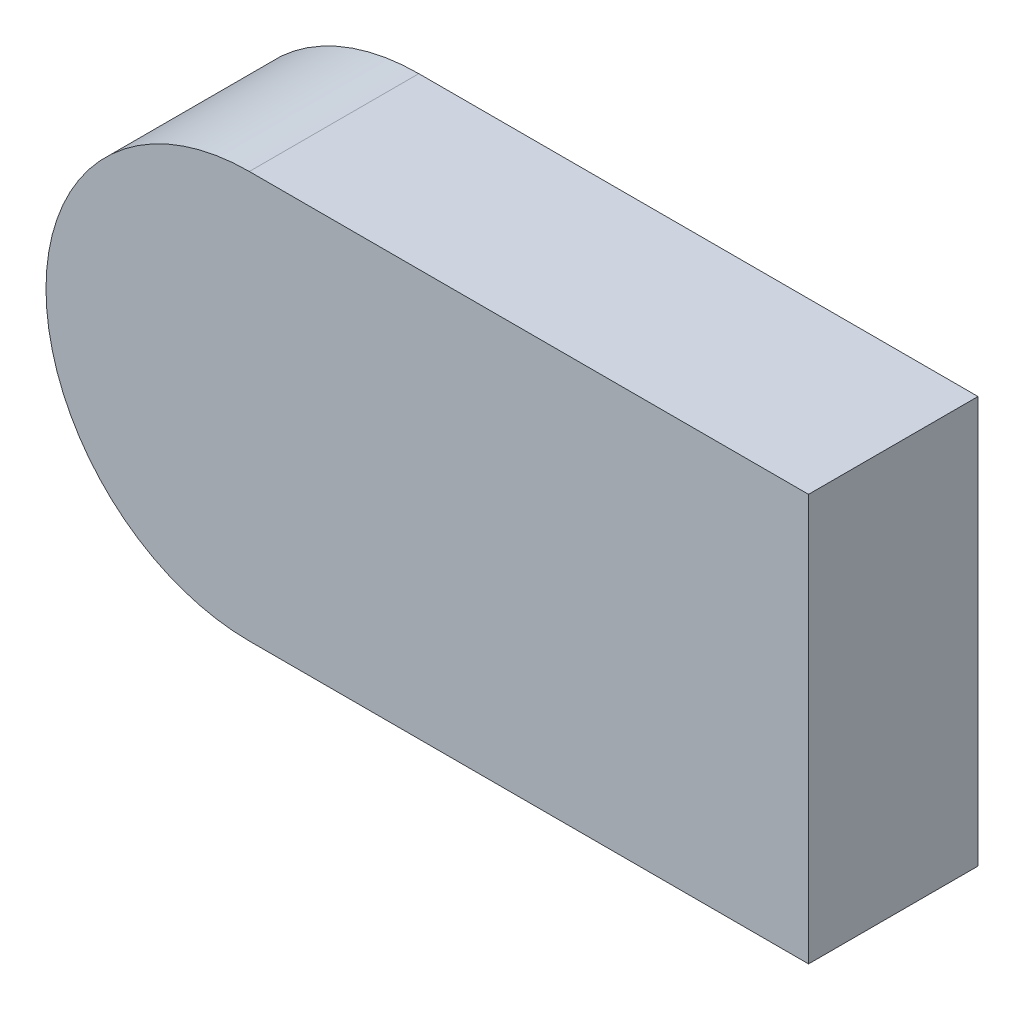
ISO-10303-21;
HEADER;
FILE_DESCRIPTION(('STEP AP214'),'2;1');
FILE_NAME('part.step','',(''),(''),'','','');
FILE_SCHEMA(('AUTOMOTIVE_DESIGN { 1 0 10303 214 1 1 1 1 }'));
ENDSEC;
DATA;
#1=APPLICATION_CONTEXT('core data for automotive mechanical design processes');
#2=APPLICATION_PROTOCOL_DEFINITION('international standard','automotive_design',2000,#1);
#3=PRODUCT_CONTEXT('',#1,'mechanical');
#4=PRODUCT('Part','Part','',(#3));
#5=PRODUCT_RELATED_PRODUCT_CATEGORY('part','',(#4));
#6=PRODUCT_DEFINITION_FORMATION('','',#4);
#7=PRODUCT_DEFINITION_CONTEXT('part definition',#1,'design');
#8=PRODUCT_DEFINITION('design','',#6,#7);
#9=PRODUCT_DEFINITION_SHAPE('','',#8);
#10=(LENGTH_UNIT() NAMED_UNIT(*) SI_UNIT(.MILLI.,.METRE.));
#11=(NAMED_UNIT(*) PLANE_ANGLE_UNIT() SI_UNIT($,.RADIAN.));
#12=(NAMED_UNIT(*) SI_UNIT($,.STERADIAN.) SOLID_ANGLE_UNIT());
#13=UNCERTAINTY_MEASURE_WITH_UNIT(LENGTH_MEASURE(1.E-05),#10,'distance_accuracy_value','');
#14=(GEOMETRIC_REPRESENTATION_CONTEXT(3) GLOBAL_UNCERTAINTY_ASSIGNED_CONTEXT((#13)) GLOBAL_UNIT_ASSIGNED_CONTEXT((#10,
#11,#12)) REPRESENTATION_CONTEXT('',''));
#15=CARTESIAN_POINT('',(0.,0.,0.));
#16=DIRECTION('',(0.,0.,1.));
#17=DIRECTION('',(1.,0.,0.));
#18=AXIS2_PLACEMENT_3D('',#15,#16,#17);
#19=CARTESIAN_POINT('',(4.05,1.63,0.));
#20=DIRECTION('',(0.,-1.,0.));
#21=DIRECTION('',(-1.,0.,0.));
#22=AXIS2_PLACEMENT_3D('',#19,#20,#21);
#23=PLANE('',#22);
#24=DIRECTION('',(0.,0.,1.));
#25=VECTOR('',#24,1.);
#26=CARTESIAN_POINT('',(4.05,1.63,0.));
#27=LINE('',#26,#25);
#28=CARTESIAN_POINT('',(4.05,1.63,0.));
#29=VERTEX_POINT('',#28);
#30=CARTESIAN_POINT('',(4.05,1.63,0.1));
#31=VERTEX_POINT('',#30);
#32=EDGE_CURVE('E11',#29,#31,#27,.T.);
#33=ORIENTED_EDGE('',*,*,#32,.T.);
#34=DIRECTION('',(-1.,0.,0.));
#35=VECTOR('',#34,1.);
#36=CARTESIAN_POINT('',(4.05,1.63,0.1));
#37=LINE('',#36,#35);
#38=CARTESIAN_POINT('',(3.72,1.63,0.1));
#39=VERTEX_POINT('',#38);
#40=EDGE_CURVE('E24',#31,#39,#37,.T.);
#41=ORIENTED_EDGE('',*,*,#40,.T.);
#42=DIRECTION('',(0.,0.,1.));
#43=VECTOR('',#42,1.);
#44=CARTESIAN_POINT('',(3.72,1.63,0.));
#45=LINE('',#44,#43);
#46=CARTESIAN_POINT('',(3.72,1.63,0.));
#47=VERTEX_POINT('',#46);
#48=EDGE_CURVE('E86',#47,#39,#45,.T.);
#49=ORIENTED_EDGE('',*,*,#48,.F.);
#50=DIRECTION('',(-1.,0.,0.));
#51=VECTOR('',#50,1.);
#52=CARTESIAN_POINT('',(4.05,1.63,0.));
#53=LINE('',#52,#51);
#54=EDGE_CURVE('E83',#29,#47,#53,.T.);
#55=ORIENTED_EDGE('',*,*,#54,.F.);
#56=EDGE_LOOP('',(#33,#41,#49,#55));
#57=FACE_BOUND('',#56,.T.);
#58=ADVANCED_FACE('F17',(#57),#23,.T.);
#59=CARTESIAN_POINT('',(3.72,1.75,0.));
#60=DIRECTION('',(0.,0.,-1.));
#61=DIRECTION('',(1.,0.,0.));
#62=AXIS2_PLACEMENT_3D('',#59,#60,#61);
#63=CYLINDRICAL_SURFACE('',#62,0.12);
#64=CARTESIAN_POINT('',(3.72,1.75,0.));
#65=DIRECTION('',(0.,0.,1.));
#66=DIRECTION('',(1.,0.,0.));
#67=AXIS2_PLACEMENT_3D('',#64,#65,#66);
#68=CIRCLE('',#67,0.12);
#69=CARTESIAN_POINT('',(3.72,1.87,0.));
#70=VERTEX_POINT('',#69);
#71=EDGE_CURVE('E80',#70,#47,#68,.T.);
#72=ORIENTED_EDGE('',*,*,#71,.T.);
#73=ORIENTED_EDGE('',*,*,#48,.T.);
#74=CARTESIAN_POINT('',(3.72,1.75,0.1));
#75=DIRECTION('',(0.,0.,1.));
#76=DIRECTION('',(1.,0.,0.));
#77=AXIS2_PLACEMENT_3D('',#74,#75,#76);
#78=CIRCLE('',#77,0.12);
#79=CARTESIAN_POINT('',(3.72,1.87,0.1));
#80=VERTEX_POINT('',#79);
#81=EDGE_CURVE('E78',#80,#39,#78,.T.);
#82=ORIENTED_EDGE('',*,*,#81,.F.);
#83=DIRECTION('',(0.,0.,1.));
#84=VECTOR('',#83,1.);
#85=CARTESIAN_POINT('',(3.72,1.87,0.));
#86=LINE('',#85,#84);
#87=EDGE_CURVE('E67',#70,#80,#86,.T.);
#88=ORIENTED_EDGE('',*,*,#87,.F.);
#89=EDGE_LOOP('',(#72,#73,#82,#88));
#90=FACE_BOUND('',#89,.T.);
#91=ADVANCED_FACE('F89',(#90),#63,.T.);
#92=CARTESIAN_POINT('',(4.05,1.87,0.));
#93=DIRECTION('',(0.,-1.,0.));
#94=DIRECTION('',(-1.,0.,0.));
#95=AXIS2_PLACEMENT_3D('',#92,#93,#94);
#96=PLANE('',#95);
#97=DIRECTION('',(-1.,0.,0.));
#98=VECTOR('',#97,1.);
#99=CARTESIAN_POINT('',(4.05,1.87,0.));
#100=LINE('',#99,#98);
#101=CARTESIAN_POINT('',(4.05,1.87,0.));
#102=VERTEX_POINT('',#101);
#103=EDGE_CURVE('E70',#102,#70,#100,.T.);
#104=ORIENTED_EDGE('',*,*,#103,.T.);
#105=ORIENTED_EDGE('',*,*,#87,.T.);
#106=DIRECTION('',(-1.,0.,0.));
#107=VECTOR('',#106,1.);
#108=CARTESIAN_POINT('',(4.05,1.87,0.1));
#109=LINE('',#108,#107);
#110=CARTESIAN_POINT('',(4.05,1.87,0.1));
#111=VERTEX_POINT('',#110);
#112=EDGE_CURVE('E61',#111,#80,#109,.T.);
#113=ORIENTED_EDGE('',*,*,#112,.F.);
#114=DIRECTION('',(0.,0.,1.));
#115=VECTOR('',#114,1.);
#116=CARTESIAN_POINT('',(4.05,1.87,0.));
#117=LINE('',#116,#115);
#118=EDGE_CURVE('E51',#102,#111,#117,.T.);
#119=ORIENTED_EDGE('',*,*,#118,.F.);
#120=EDGE_LOOP('',(#104,#105,#113,#119));
#121=FACE_BOUND('',#120,.T.);
#122=ADVANCED_FACE('F65',(#121),#96,.F.);
#123=CARTESIAN_POINT('',(4.05,1.63,0.));
#124=DIRECTION('',(-1.,0.,0.));
#125=DIRECTION('',(0.,1.,0.));
#126=AXIS2_PLACEMENT_3D('',#123,#124,#125);
#127=PLANE('',#126);
#128=DIRECTION('',(0.,1.,0.));
#129=VECTOR('',#128,1.);
#130=CARTESIAN_POINT('',(4.05,1.63,0.));
#131=LINE('',#130,#129);
#132=EDGE_CURVE('E57',#29,#102,#131,.T.);
#133=ORIENTED_EDGE('',*,*,#132,.T.);
#134=ORIENTED_EDGE('',*,*,#118,.T.);
#135=DIRECTION('',(0.,1.,0.));
#136=VECTOR('',#135,1.);
#137=CARTESIAN_POINT('',(4.05,1.63,0.1));
#138=LINE('',#137,#136);
#139=EDGE_CURVE('E55',#31,#111,#138,.T.);
#140=ORIENTED_EDGE('',*,*,#139,.F.);
#141=ORIENTED_EDGE('',*,*,#32,.F.);
#142=EDGE_LOOP('',(#133,#134,#140,#141));
#143=FACE_BOUND('',#142,.T.);
#144=ADVANCED_FACE('F53',(#143),#127,.F.);
#145=CARTESIAN_POINT('',(3.849490847913,1.75,0.));
#146=DIRECTION('',(0.,0.,-1.));
#147=DIRECTION('',(-1.,0.,0.));
#148=AXIS2_PLACEMENT_3D('',#145,#146,#147);
#149=PLANE('',#148);
#150=ORIENTED_EDGE('',*,*,#54,.T.);
#151=ORIENTED_EDGE('',*,*,#71,.F.);
#152=ORIENTED_EDGE('',*,*,#103,.F.);
#153=ORIENTED_EDGE('',*,*,#132,.F.);
#154=EDGE_LOOP('',(#150,#151,#152,#153));
#155=FACE_BOUND('',#154,.T.);
#156=ADVANCED_FACE('F91',(#155),#149,.T.);
#157=CARTESIAN_POINT('',(3.849490847913,1.75,0.1));
#158=DIRECTION('',(0.,0.,-1.));
#159=DIRECTION('',(-1.,0.,0.));
#160=AXIS2_PLACEMENT_3D('',#157,#158,#159);
#161=PLANE('',#160);
#162=ORIENTED_EDGE('',*,*,#139,.T.);
#163=ORIENTED_EDGE('',*,*,#112,.T.);
#164=ORIENTED_EDGE('',*,*,#81,.T.);
#165=ORIENTED_EDGE('',*,*,#40,.F.);
#166=EDGE_LOOP('',(#162,#163,#164,#165));
#167=FACE_BOUND('',#166,.T.);
#168=ADVANCED_FACE('F72',(#167),#161,.F.);
#169=CLOSED_SHELL('',(#58,#91,#122,#144,#156,#168));
#170=MANIFOLD_SOLID_BREP('B1',#169);
#171=ADVANCED_BREP_SHAPE_REPRESENTATION('',(#18,#170),#14);
#172=SHAPE_DEFINITION_REPRESENTATION(#9,#171);
ENDSEC;
END-ISO-10303-21;
